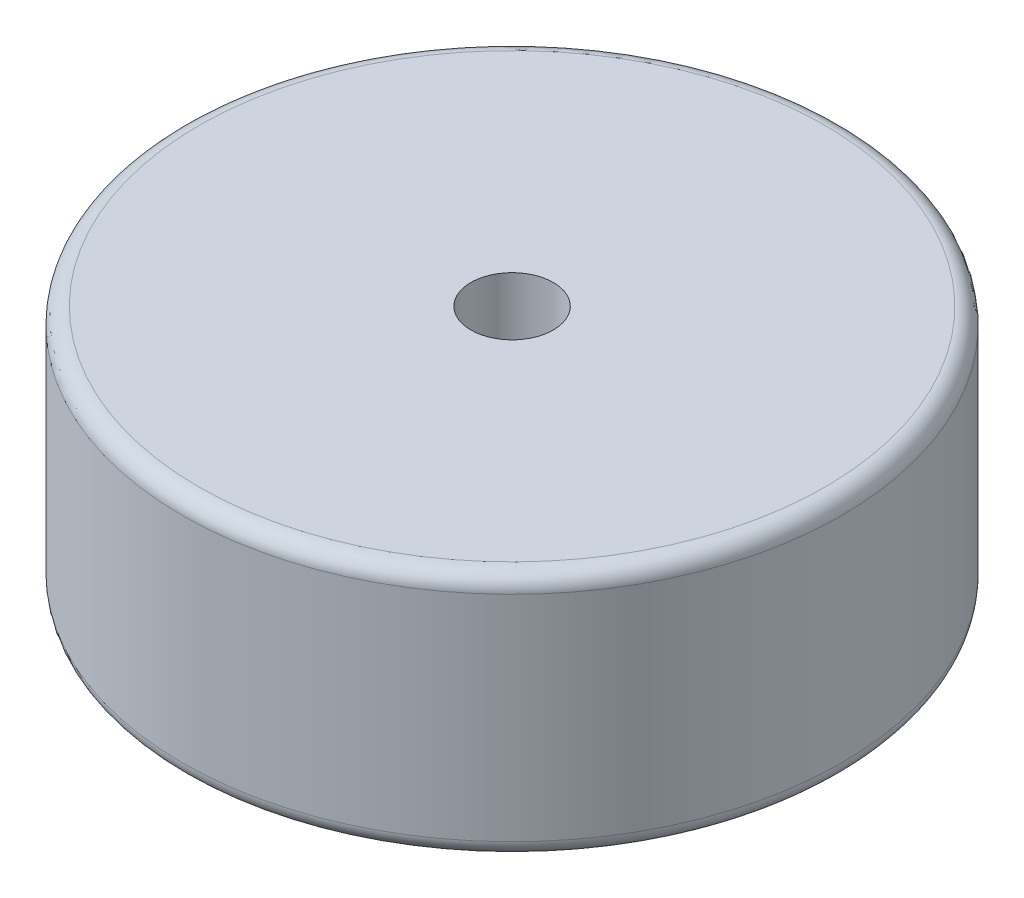
ISO-10303-21;
HEADER;
FILE_DESCRIPTION(('STEP AP214'),'2;1');
FILE_NAME('part.step','',(''),(''),'','','');
FILE_SCHEMA(('AUTOMOTIVE_DESIGN { 1 0 10303 214 1 1 1 1 }'));
ENDSEC;
DATA;
#1=APPLICATION_CONTEXT('core data for automotive mechanical design processes');
#2=APPLICATION_PROTOCOL_DEFINITION('international standard','automotive_design',2000,#1);
#3=PRODUCT_CONTEXT('',#1,'mechanical');
#4=PRODUCT('Part','Part','',(#3));
#5=PRODUCT_RELATED_PRODUCT_CATEGORY('part','',(#4));
#6=PRODUCT_DEFINITION_FORMATION('','',#4);
#7=PRODUCT_DEFINITION_CONTEXT('part definition',#1,'design');
#8=PRODUCT_DEFINITION('design','',#6,#7);
#9=PRODUCT_DEFINITION_SHAPE('','',#8);
#10=(LENGTH_UNIT() NAMED_UNIT(*) SI_UNIT(.MILLI.,.METRE.));
#11=(NAMED_UNIT(*) PLANE_ANGLE_UNIT() SI_UNIT($,.RADIAN.));
#12=(NAMED_UNIT(*) SI_UNIT($,.STERADIAN.) SOLID_ANGLE_UNIT());
#13=UNCERTAINTY_MEASURE_WITH_UNIT(LENGTH_MEASURE(1.E-05),#10,'distance_accuracy_value','');
#14=(GEOMETRIC_REPRESENTATION_CONTEXT(3) GLOBAL_UNCERTAINTY_ASSIGNED_CONTEXT((#13)) GLOBAL_UNIT_ASSIGNED_CONTEXT((#10,
#11,#12)) REPRESENTATION_CONTEXT('',''));
#15=CARTESIAN_POINT('',(0.,0.,0.));
#16=DIRECTION('',(0.,0.,1.));
#17=DIRECTION('',(1.,0.,0.));
#18=AXIS2_PLACEMENT_3D('',#15,#16,#17);
#19=CARTESIAN_POINT('',(0.,1.5,0.));
#20=DIRECTION('',(0.,1.,0.));
#21=DIRECTION('',(0.,0.,1.));
#22=AXIS2_PLACEMENT_3D('',#19,#20,#21);
#23=PLANE('',#22);
#24=CARTESIAN_POINT('',(0.,1.5,0.));
#25=DIRECTION('',(0.,1.,0.));
#26=DIRECTION('',(0.,0.,1.));
#27=AXIS2_PLACEMENT_3D('',#24,#25,#26);
#28=CIRCLE('',#27,1.9);
#29=CARTESIAN_POINT('',(0.,1.5,1.9));
#30=VERTEX_POINT('',#29);
#31=EDGE_CURVE('E10',#30,#30,#28,.T.);
#32=ORIENTED_EDGE('',*,*,#31,.T.);
#33=EDGE_LOOP('',(#32));
#34=FACE_BOUND('',#33,.T.);
#35=CARTESIAN_POINT('',(0.,1.5,0.));
#36=DIRECTION('',(0.,1.,0.));
#37=DIRECTION('',(0.,0.,1.));
#38=AXIS2_PLACEMENT_3D('',#35,#36,#37);
#39=CIRCLE('',#38,0.25);
#40=CARTESIAN_POINT('',(0.,1.5,0.25));
#41=VERTEX_POINT('',#40);
#42=EDGE_CURVE('E54',#41,#41,#39,.T.);
#43=ORIENTED_EDGE('',*,*,#42,.F.);
#44=EDGE_LOOP('',(#43));
#45=FACE_BOUND('',#44,.T.);
#46=ADVANCED_FACE('F34',(#34,#45),#23,.T.);
#47=CARTESIAN_POINT('',(0.,0.,0.));
#48=DIRECTION('',(0.,1.,0.));
#49=DIRECTION('',(0.,0.,1.));
#50=AXIS2_PLACEMENT_3D('',#47,#48,#49);
#51=PLANE('',#50);
#52=CARTESIAN_POINT('',(0.,0.,0.));
#53=DIRECTION('',(0.,1.,0.));
#54=DIRECTION('',(0.,0.,1.));
#55=AXIS2_PLACEMENT_3D('',#52,#53,#54);
#56=CIRCLE('',#55,1.9);
#57=CARTESIAN_POINT('',(0.,0.,1.9));
#58=VERTEX_POINT('',#57);
#59=EDGE_CURVE('E41',#58,#58,#56,.F.);
#60=ORIENTED_EDGE('',*,*,#59,.T.);
#61=EDGE_LOOP('',(#60));
#62=FACE_BOUND('',#61,.T.);
#63=CARTESIAN_POINT('',(0.,0.,0.));
#64=DIRECTION('',(0.,1.,0.));
#65=DIRECTION('',(0.,0.,1.));
#66=AXIS2_PLACEMENT_3D('',#63,#64,#65);
#67=CIRCLE('',#66,0.25);
#68=CARTESIAN_POINT('',(0.,0.,0.25));
#69=VERTEX_POINT('',#68);
#70=EDGE_CURVE('E55',#69,#69,#67,.T.);
#71=ORIENTED_EDGE('',*,*,#70,.T.);
#72=EDGE_LOOP('',(#71));
#73=FACE_BOUND('',#72,.T.);
#74=ADVANCED_FACE('F65',(#62,#73),#51,.F.);
#75=CARTESIAN_POINT('',(0.,1.5,0.));
#76=DIRECTION('',(0.,-1.,0.));
#77=DIRECTION('',(0.,0.,-1.));
#78=AXIS2_PLACEMENT_3D('',#75,#76,#77);
#79=CYLINDRICAL_SURFACE('',#78,2.);
#80=CARTESIAN_POINT('',(0.,0.1,0.));
#81=DIRECTION('',(0.,1.,0.));
#82=DIRECTION('',(0.,0.,1.));
#83=AXIS2_PLACEMENT_3D('',#80,#81,#82);
#84=CIRCLE('',#83,2.);
#85=CARTESIAN_POINT('',(0.,0.1,2.));
#86=VERTEX_POINT('',#85);
#87=EDGE_CURVE('E45',#86,#86,#84,.T.);
#88=ORIENTED_EDGE('',*,*,#87,.T.);
#89=EDGE_LOOP('',(#88));
#90=FACE_BOUND('',#89,.T.);
#91=CARTESIAN_POINT('',(0.,1.4,0.));
#92=DIRECTION('',(0.,1.,0.));
#93=DIRECTION('',(0.,0.,1.));
#94=AXIS2_PLACEMENT_3D('',#91,#92,#93);
#95=CIRCLE('',#94,2.);
#96=CARTESIAN_POINT('',(0.,1.4,2.));
#97=VERTEX_POINT('',#96);
#98=EDGE_CURVE('E49',#97,#97,#95,.F.);
#99=ORIENTED_EDGE('',*,*,#98,.T.);
#100=EDGE_LOOP('',(#99));
#101=FACE_BOUND('',#100,.T.);
#102=ADVANCED_FACE('F70',(#90,#101),#79,.T.);
#103=CARTESIAN_POINT('',(0.,1.5,0.));
#104=DIRECTION('',(0.,-1.,0.));
#105=DIRECTION('',(0.,0.,-1.));
#106=AXIS2_PLACEMENT_3D('',#103,#104,#105);
#107=CYLINDRICAL_SURFACE('',#106,0.25);
#108=ORIENTED_EDGE('',*,*,#42,.T.);
#109=EDGE_LOOP('',(#108));
#110=FACE_BOUND('',#109,.T.);
#111=ORIENTED_EDGE('',*,*,#70,.F.);
#112=EDGE_LOOP('',(#111));
#113=FACE_BOUND('',#112,.T.);
#114=ADVANCED_FACE('F61',(#110,#113),#107,.F.);
#115=CARTESIAN_POINT('',(0.,0.1,0.));
#116=DIRECTION('',(0.,1.,0.));
#117=DIRECTION('',(0.,0.,1.));
#118=AXIS2_PLACEMENT_3D('',#115,#116,#117);
#119=TOROIDAL_SURFACE('',#118,1.9,0.1);
#120=ORIENTED_EDGE('',*,*,#59,.F.);
#121=EDGE_LOOP('',(#120));
#122=FACE_BOUND('',#121,.T.);
#123=ORIENTED_EDGE('',*,*,#87,.F.);
#124=EDGE_LOOP('',(#123));
#125=FACE_BOUND('',#124,.T.);
#126=ADVANCED_FACE('F76',(#122,#125),#119,.T.);
#127=CARTESIAN_POINT('',(0.,1.4,0.));
#128=DIRECTION('',(0.,1.,0.));
#129=DIRECTION('',(0.,0.,1.));
#130=AXIS2_PLACEMENT_3D('',#127,#128,#129);
#131=TOROIDAL_SURFACE('',#130,1.9,0.1);
#132=ORIENTED_EDGE('',*,*,#98,.F.);
#133=EDGE_LOOP('',(#132));
#134=FACE_BOUND('',#133,.T.);
#135=ORIENTED_EDGE('',*,*,#31,.F.);
#136=EDGE_LOOP('',(#135));
#137=FACE_BOUND('',#136,.T.);
#138=ADVANCED_FACE('F36',(#134,#137),#131,.T.);
#139=CLOSED_SHELL('',(#46,#74,#102,#114,#126,#138));
#140=MANIFOLD_SOLID_BREP('B2',#139);
#141=ADVANCED_BREP_SHAPE_REPRESENTATION('',(#18,#140),#14);
#142=SHAPE_DEFINITION_REPRESENTATION(#9,#141);
ENDSEC;
END-ISO-10303-21;
